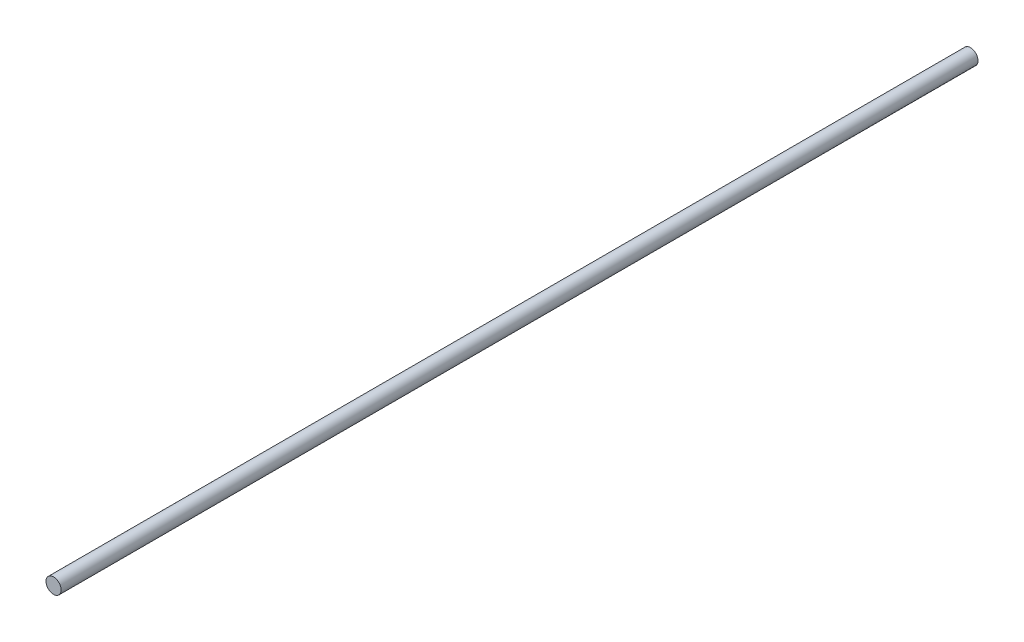
ISO-10303-21;
HEADER;
FILE_DESCRIPTION(('STEP AP214'),'2;1');
FILE_NAME('part.step','',(''),(''),'','','');
FILE_SCHEMA(('AUTOMOTIVE_DESIGN { 1 0 10303 214 1 1 1 1 }'));
ENDSEC;
DATA;
#1=APPLICATION_CONTEXT('core data for automotive mechanical design processes');
#2=APPLICATION_PROTOCOL_DEFINITION('international standard','automotive_design',2000,#1);
#3=PRODUCT_CONTEXT('',#1,'mechanical');
#4=PRODUCT('Part','Part','',(#3));
#5=PRODUCT_RELATED_PRODUCT_CATEGORY('part','',(#4));
#6=PRODUCT_DEFINITION_FORMATION('','',#4);
#7=PRODUCT_DEFINITION_CONTEXT('part definition',#1,'design');
#8=PRODUCT_DEFINITION('design','',#6,#7);
#9=PRODUCT_DEFINITION_SHAPE('','',#8);
#10=(LENGTH_UNIT() NAMED_UNIT(*) SI_UNIT(.MILLI.,.METRE.));
#11=(NAMED_UNIT(*) PLANE_ANGLE_UNIT() SI_UNIT($,.RADIAN.));
#12=(NAMED_UNIT(*) SI_UNIT($,.STERADIAN.) SOLID_ANGLE_UNIT());
#13=UNCERTAINTY_MEASURE_WITH_UNIT(LENGTH_MEASURE(1.E-05),#10,'distance_accuracy_value','');
#14=(GEOMETRIC_REPRESENTATION_CONTEXT(3) GLOBAL_UNCERTAINTY_ASSIGNED_CONTEXT((#13)) GLOBAL_UNIT_ASSIGNED_CONTEXT((#10,
#11,#12)) REPRESENTATION_CONTEXT('',''));
#15=CARTESIAN_POINT('',(0.,0.,0.));
#16=DIRECTION('',(0.,0.,1.));
#17=DIRECTION('',(1.,0.,0.));
#18=AXIS2_PLACEMENT_3D('',#15,#16,#17);
#19=CARTESIAN_POINT('',(0.,0.,240.));
#20=DIRECTION('',(0.,0.,-1.));
#21=DIRECTION('',(-1.,0.,0.));
#22=AXIS2_PLACEMENT_3D('',#19,#20,#21);
#23=CYLINDRICAL_SURFACE('',#22,3.97);
#24=CARTESIAN_POINT('',(0.,0.,240.));
#25=DIRECTION('',(0.,0.,1.));
#26=DIRECTION('',(1.,0.,0.));
#27=AXIS2_PLACEMENT_3D('',#24,#25,#26);
#28=CIRCLE('',#27,3.97);
#29=CARTESIAN_POINT('',(3.97,0.,240.));
#30=VERTEX_POINT('',#29);
#31=EDGE_CURVE('E10',#30,#30,#28,.T.);
#32=ORIENTED_EDGE('',*,*,#31,.F.);
#33=EDGE_LOOP('',(#32));
#34=FACE_BOUND('',#33,.T.);
#35=CARTESIAN_POINT('',(0.,0.,-240.));
#36=DIRECTION('',(0.,0.,1.));
#37=DIRECTION('',(1.,0.,0.));
#38=AXIS2_PLACEMENT_3D('',#35,#36,#37);
#39=CIRCLE('',#38,3.97);
#40=CARTESIAN_POINT('',(3.97,0.,-240.));
#41=VERTEX_POINT('',#40);
#42=EDGE_CURVE('E39',#41,#41,#39,.T.);
#43=ORIENTED_EDGE('',*,*,#42,.T.);
#44=EDGE_LOOP('',(#43));
#45=FACE_BOUND('',#44,.T.);
#46=ADVANCED_FACE('F36',(#34,#45),#23,.T.);
#47=CARTESIAN_POINT('',(0.,0.,240.));
#48=DIRECTION('',(0.,0.,1.));
#49=DIRECTION('',(1.,0.,0.));
#50=AXIS2_PLACEMENT_3D('',#47,#48,#49);
#51=PLANE('',#50);
#52=ORIENTED_EDGE('',*,*,#31,.T.);
#53=EDGE_LOOP('',(#52));
#54=FACE_BOUND('',#53,.T.);
#55=ADVANCED_FACE('F51',(#54),#51,.T.);
#56=CARTESIAN_POINT('',(0.,0.,-240.));
#57=DIRECTION('',(0.,0.,1.));
#58=DIRECTION('',(1.,0.,0.));
#59=AXIS2_PLACEMENT_3D('',#56,#57,#58);
#60=PLANE('',#59);
#61=ORIENTED_EDGE('',*,*,#42,.F.);
#62=EDGE_LOOP('',(#61));
#63=FACE_BOUND('',#62,.T.);
#64=ADVANCED_FACE('F49',(#63),#60,.F.);
#65=CLOSED_SHELL('',(#46,#55,#64));
#66=MANIFOLD_SOLID_BREP('B2',#65);
#67=ADVANCED_BREP_SHAPE_REPRESENTATION('',(#18,#66),#14);
#68=SHAPE_DEFINITION_REPRESENTATION(#9,#67);
ENDSEC;
END-ISO-10303-21;
